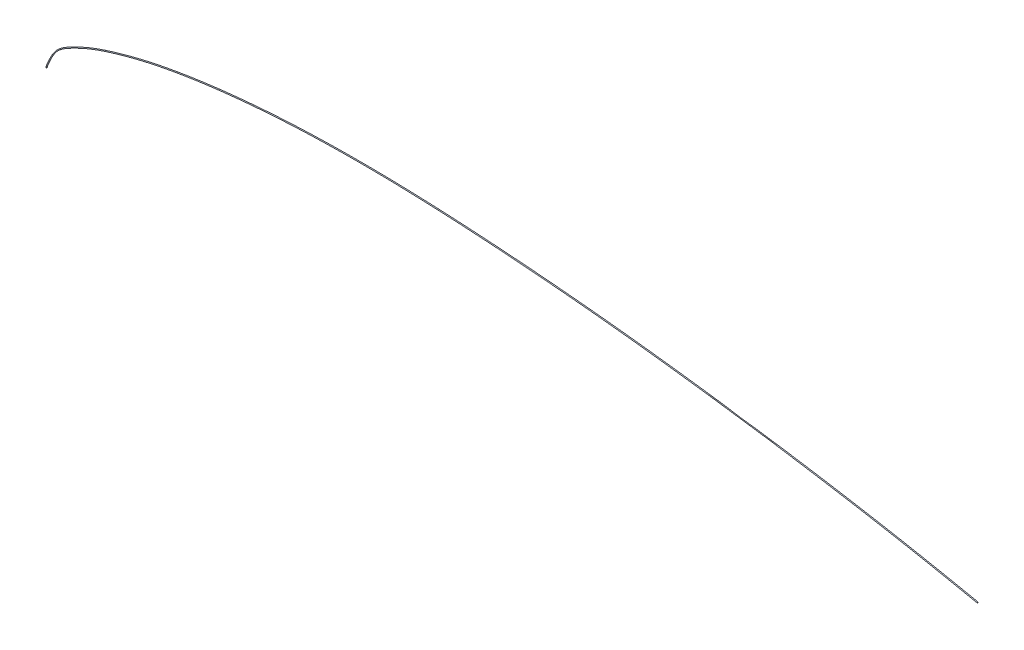
ISO-10303-21;
HEADER;
FILE_DESCRIPTION(('STEP AP214'),'2;1');
FILE_NAME('part.step','',(''),(''),'','','');
FILE_SCHEMA(('AUTOMOTIVE_DESIGN { 1 0 10303 214 1 1 1 1 }'));
ENDSEC;
DATA;
#1=APPLICATION_CONTEXT('core data for automotive mechanical design processes');
#2=APPLICATION_PROTOCOL_DEFINITION('international standard','automotive_design',2000,#1);
#3=PRODUCT_CONTEXT('',#1,'mechanical');
#4=PRODUCT('Part','Part','',(#3));
#5=PRODUCT_RELATED_PRODUCT_CATEGORY('part','',(#4));
#6=PRODUCT_DEFINITION_FORMATION('','',#4);
#7=PRODUCT_DEFINITION_CONTEXT('part definition',#1,'design');
#8=PRODUCT_DEFINITION('design','',#6,#7);
#9=PRODUCT_DEFINITION_SHAPE('','',#8);
#10=(LENGTH_UNIT() NAMED_UNIT(*) SI_UNIT(.MILLI.,.METRE.));
#11=(NAMED_UNIT(*) PLANE_ANGLE_UNIT() SI_UNIT($,.RADIAN.));
#12=(NAMED_UNIT(*) SI_UNIT($,.STERADIAN.) SOLID_ANGLE_UNIT());
#13=UNCERTAINTY_MEASURE_WITH_UNIT(LENGTH_MEASURE(1.E-05),#10,'distance_accuracy_value','');
#14=(GEOMETRIC_REPRESENTATION_CONTEXT(3) GLOBAL_UNCERTAINTY_ASSIGNED_CONTEXT((#13)) GLOBAL_UNIT_ASSIGNED_CONTEXT((#10,
#11,#12)) REPRESENTATION_CONTEXT('',''));
#15=CARTESIAN_POINT('',(0.,0.,0.));
#16=DIRECTION('',(0.,0.,1.));
#17=DIRECTION('',(1.,0.,0.));
#18=AXIS2_PLACEMENT_3D('',#15,#16,#17);
#19=CARTESIAN_POINT('',(982.37,1.277081,0.));
#20=DIRECTION('',(0.98101772640487,0.193918076721638,0.));
#21=DIRECTION('',(0.,0.,1.));
#22=AXIS2_PLACEMENT_3D('',#19,#20,#21);
#23=PLANE('',#22);
#24=CARTESIAN_POINT('',(982.37,1.277081,0.));
#25=DIRECTION('',(0.98101772640487,0.193918076721638,0.));
#26=DIRECTION('',(0.,0.,1.));
#27=AXIS2_PLACEMENT_3D('',#24,#25,#26);
#28=CIRCLE('',#27,0.5);
#29=CARTESIAN_POINT('',(982.37,1.277081,0.5));
#30=VERTEX_POINT('',#29);
#31=EDGE_CURVE('E10',#30,#30,#28,.T.);
#32=ORIENTED_EDGE('',*,*,#31,.T.);
#33=EDGE_LOOP('',(#32));
#34=FACE_BOUND('',#33,.T.);
#35=ADVANCED_FACE('F37',(#34),#23,.T.);
#36=CARTESIAN_POINT('',(982.37,1.277081,0.5));
#37=CARTESIAN_POINT('',(966.006247692632,4.63023753531084,0.5));
#38=CARTESIAN_POINT('',(949.64249538203,7.98339407107312,0.5));
#39=CARTESIAN_POINT('',(884.325588967302,20.7974180113734,0.5));
#40=CARTESIAN_POINT('',(835.170749762555,29.2208354174456,0.5));
#41=CARTESIAN_POINT('',(753.204713954217,41.8930561435161,0.5));
#42=CARTESIAN_POINT('',(720.457598988852,46.5816054311459,0.5));
#43=CARTESIAN_POINT('',(654.965430300209,55.178140371645,0.5));
#44=CARTESIAN_POINT('',(622.220705780157,59.088577507133,0.5));
#45=CARTESIAN_POINT('',(556.72340320794,65.8585389828754,0.5));
#46=CARTESIAN_POINT('',(523.971154173901,68.7212345165416,0.5));
#47=CARTESIAN_POINT('',(458.473890529683,73.5204427017436,0.5));
#48=CARTESIAN_POINT('',(425.729030955599,75.4590603090154,0.5));
#49=CARTESIAN_POINT('',(360.217201786401,77.7888732518948,0.5));
#50=CARTESIAN_POINT('',(327.450342968571,78.1824352617219,0.5));
#51=CARTESIAN_POINT('',(261.903332539602,76.6374663029844,0.5));
#52=CARTESIAN_POINT('',(229.113072819916,74.7211664786091,0.5));
#53=CARTESIAN_POINT('',(179.965527901329,69.5998220072903,0.5));
#54=CARTESIAN_POINT('',(163.498338532072,67.4928260856141,0.5));
#55=CARTESIAN_POINT('',(130.697575950852,62.2949459092975,0.5));
#56=CARTESIAN_POINT('',(114.364585446865,59.2029975403183,0.5));
#57=CARTESIAN_POINT('',(89.9285245792287,53.3005454090448,0.5));
#58=CARTESIAN_POINT('',(81.6745496994335,51.0803969997088,0.5));
#59=CARTESIAN_POINT('',(65.2472627690558,46.243098791399,0.5));
#60=CARTESIAN_POINT('',(57.0755665289918,43.6238149687629,0.5));
#61=CARTESIAN_POINT('',(43.9833416859353,38.6022903177345,0.5));
#62=CARTESIAN_POINT('',(38.9375739069987,36.4525063723427,0.5));
#63=CARTESIAN_POINT('',(31.4498674362683,32.913379283491,0.5));
#64=CARTESIAN_POINT('',(28.9674561457282,31.681261725483,0.5));
#65=CARTESIAN_POINT('',(24.0207585296471,29.1048493398776,0.5));
#66=CARTESIAN_POINT('',(21.5337905450468,27.7759853581103,0.5));
#67=CARTESIAN_POINT('',(16.7882920380453,24.8496141050762,0.5));
#68=CARTESIAN_POINT('',(14.5377722111785,23.2466569766948,0.5));
#69=CARTESIAN_POINT('',(10.5905898574913,19.5373232835405,0.5));
#70=CARTESIAN_POINT('',(8.90492918725965,17.4222238719549,0.5));
#71=CARTESIAN_POINT('',(4.42778144185482,10.5529103062656,0.5));
#72=CARTESIAN_POINT('',(2.21389071966054,5.27645515427274,0.5));
#73=CARTESIAN_POINT('',(0.,0.,0.5));
#74=CARTESIAN_POINT('',(982.563918076722,0.29606327359513,0.5));
#75=CARTESIAN_POINT('',(966.200165767499,3.64921980892499,0.5));
#76=CARTESIAN_POINT('',(949.839160604952,7.00290740477424,0.5));
#77=CARTESIAN_POINT('',(884.544092714158,19.8214389613463,0.5));
#78=CARTESIAN_POINT('',(835.40131775265,28.2477143375043,0.5));
#79=CARTESIAN_POINT('',(753.453418381785,40.9244480332833,0.5));
#80=CARTESIAN_POINT('',(720.713682314235,45.6149192850411,0.5));
#81=CARTESIAN_POINT('',(655.236529757715,54.2155576629643,0.5));
#82=CARTESIAN_POINT('',(622.500629401233,58.1284969837561,0.5));
#83=CARTESIAN_POINT('',(557.023538067243,64.9045839369948,0.5));
#84=CARTESIAN_POINT('',(524.280762680364,67.7703243225816,0.5));
#85=CARTESIAN_POINT('',(458.801225424324,72.5754881578468,0.5));
#86=CARTESIAN_POINT('',(426.06821064823,74.5182073184651,0.5));
#87=CARTESIAN_POINT('',(360.58577013235,76.8591400470335,0.5));
#88=CARTESIAN_POINT('',(327.837209483476,77.2599943142502,0.5));
#89=CARTESIAN_POINT('',(262.333558984971,75.7344322172876,0.5));
#90=CARTESIAN_POINT('',(229.566371993328,73.8292730265615,0.5));
#91=CARTESIAN_POINT('',(180.459619649967,68.730271884403,0.5));
#92=CARTESIAN_POINT('',(164.007817596871,66.6321112630241,0.5));
#93=CARTESIAN_POINT('',(131.241017201513,61.4552611290608,0.5));
#94=CARTESIAN_POINT('',(114.930337108243,58.3777486950091,0.5));
#95=CARTESIAN_POINT('',(90.5349492372928,52.5052191305762,0.5));
#96=CARTESIAN_POINT('',(82.2938385739548,50.2950726401932,0.5));
#97=CARTESIAN_POINT('',(65.8912176146056,45.4778699258685,0.5));
#98=CARTESIAN_POINT('',(57.7398604672087,42.8753977992402,0.5));
#99=CARTESIAN_POINT('',(44.6923426157801,37.8966651450928,0.5));
#100=CARTESIAN_POINT('',(39.664263852104,35.7650613796964,0.5));
#101=CARTESIAN_POINT('',(32.2022911793308,32.2545748857836,0.5));
#102=CARTESIAN_POINT('',(29.7283254048874,31.0322284458354,0.5));
#103=CARTESIAN_POINT('',(24.7981079747776,28.475648205275,0.5));
#104=CARTESIAN_POINT('',(22.3216395958269,27.1585617769766,0.5));
#105=CARTESIAN_POINT('',(17.6271013267159,24.3034300862453,0.5));
#106=CARTESIAN_POINT('',(15.4138163425942,22.7557596830098,0.5));
#107=CARTESIAN_POINT('',(11.5413894191943,19.2141922479197,0.5));
#108=CARTESIAN_POINT('',(9.87748593080348,17.1812874766036,0.5));
#109=CARTESIAN_POINT('',(5.43401535512678,10.4966859659683,0.5));
#110=CARTESIAN_POINT('',(3.21389071965992,5.27645515427274,0.5));
#111=CARTESIAN_POINT('',(1.,0.,0.5));
#112=CARTESIAN_POINT('',(982.563918076722,0.29606327359513,-0.5));
#113=CARTESIAN_POINT('',(966.200165767499,3.64921980892499,-0.5));
#114=CARTESIAN_POINT('',(949.839160604952,7.00290740477424,-0.5));
#115=CARTESIAN_POINT('',(884.544092714158,19.8214389613463,-0.5));
#116=CARTESIAN_POINT('',(835.40131775265,28.2477143375043,-0.5));
#117=CARTESIAN_POINT('',(753.453418381785,40.9244480332833,-0.5));
#118=CARTESIAN_POINT('',(720.713682314235,45.6149192850411,-0.5));
#119=CARTESIAN_POINT('',(655.236529757715,54.2155576629643,-0.5));
#120=CARTESIAN_POINT('',(622.500629401233,58.1284969837561,-0.5));
#121=CARTESIAN_POINT('',(557.023538067243,64.9045839369948,-0.5));
#122=CARTESIAN_POINT('',(524.280762680364,67.7703243225816,-0.5));
#123=CARTESIAN_POINT('',(458.801225424324,72.5754881578468,-0.5));
#124=CARTESIAN_POINT('',(426.06821064823,74.5182073184651,-0.5));
#125=CARTESIAN_POINT('',(360.58577013235,76.8591400470335,-0.5));
#126=CARTESIAN_POINT('',(327.837209483476,77.2599943142502,-0.5));
#127=CARTESIAN_POINT('',(262.333558984971,75.7344322172876,-0.5));
#128=CARTESIAN_POINT('',(229.566371993328,73.8292730265615,-0.5));
#129=CARTESIAN_POINT('',(180.459619649967,68.730271884403,-0.5));
#130=CARTESIAN_POINT('',(164.007817596871,66.6321112630241,-0.5));
#131=CARTESIAN_POINT('',(131.241017201513,61.4552611290608,-0.5));
#132=CARTESIAN_POINT('',(114.930337108243,58.3777486950091,-0.5));
#133=CARTESIAN_POINT('',(90.5349492372928,52.5052191305762,-0.5));
#134=CARTESIAN_POINT('',(82.2938385739548,50.2950726401932,-0.5));
#135=CARTESIAN_POINT('',(65.8912176146056,45.4778699258685,-0.5));
#136=CARTESIAN_POINT('',(57.7398604672087,42.8753977992402,-0.5));
#137=CARTESIAN_POINT('',(44.6923426157801,37.8966651450928,-0.5));
#138=CARTESIAN_POINT('',(39.664263852104,35.7650613796964,-0.5));
#139=CARTESIAN_POINT('',(32.2022911793308,32.2545748857836,-0.5));
#140=CARTESIAN_POINT('',(29.7283254048874,31.0322284458354,-0.5));
#141=CARTESIAN_POINT('',(24.7981079747776,28.475648205275,-0.5));
#142=CARTESIAN_POINT('',(22.3216395958269,27.1585617769766,-0.5));
#143=CARTESIAN_POINT('',(17.6271013267159,24.3034300862453,-0.5));
#144=CARTESIAN_POINT('',(15.4138163425942,22.7557596830098,-0.5));
#145=CARTESIAN_POINT('',(11.5413894191943,19.2141922479197,-0.5));
#146=CARTESIAN_POINT('',(9.87748593080348,17.1812874766036,-0.5));
#147=CARTESIAN_POINT('',(5.43401535512678,10.4966859659683,-0.5));
#148=CARTESIAN_POINT('',(3.21389071965992,5.27645515427274,-0.5));
#149=CARTESIAN_POINT('',(1.,0.,-0.5));
#150=CARTESIAN_POINT('',(982.37,1.277081,-0.5));
#151=CARTESIAN_POINT('',(966.006247692632,4.63023753531084,-0.5));
#152=CARTESIAN_POINT('',(949.64249538203,7.98339407107312,-0.5));
#153=CARTESIAN_POINT('',(884.325588967302,20.7974180113734,-0.5));
#154=CARTESIAN_POINT('',(835.170749762555,29.2208354174456,-0.5));
#155=CARTESIAN_POINT('',(753.204713954217,41.8930561435161,-0.5));
#156=CARTESIAN_POINT('',(720.457598988852,46.5816054311459,-0.5));
#157=CARTESIAN_POINT('',(654.965430300209,55.178140371645,-0.5));
#158=CARTESIAN_POINT('',(622.220705780157,59.088577507133,-0.5));
#159=CARTESIAN_POINT('',(556.72340320794,65.8585389828754,-0.5));
#160=CARTESIAN_POINT('',(523.971154173901,68.7212345165416,-0.5));
#161=CARTESIAN_POINT('',(458.473890529683,73.5204427017436,-0.5));
#162=CARTESIAN_POINT('',(425.729030955599,75.4590603090154,-0.5));
#163=CARTESIAN_POINT('',(360.217201786401,77.7888732518948,-0.5));
#164=CARTESIAN_POINT('',(327.450342968571,78.1824352617219,-0.5));
#165=CARTESIAN_POINT('',(261.903332539602,76.6374663029844,-0.5));
#166=CARTESIAN_POINT('',(229.113072819916,74.7211664786091,-0.5));
#167=CARTESIAN_POINT('',(179.965527901329,69.5998220072903,-0.5));
#168=CARTESIAN_POINT('',(163.498338532072,67.4928260856141,-0.5));
#169=CARTESIAN_POINT('',(130.697575950852,62.2949459092975,-0.5));
#170=CARTESIAN_POINT('',(114.364585446865,59.2029975403183,-0.5));
#171=CARTESIAN_POINT('',(89.9285245792287,53.3005454090448,-0.5));
#172=CARTESIAN_POINT('',(81.6745496994335,51.0803969997088,-0.5));
#173=CARTESIAN_POINT('',(65.2472627690558,46.243098791399,-0.5));
#174=CARTESIAN_POINT('',(57.0755665289918,43.6238149687629,-0.5));
#175=CARTESIAN_POINT('',(43.9833416859353,38.6022903177345,-0.5));
#176=CARTESIAN_POINT('',(38.9375739069987,36.4525063723427,-0.5));
#177=CARTESIAN_POINT('',(31.4498674362683,32.913379283491,-0.5));
#178=CARTESIAN_POINT('',(28.9674561457282,31.681261725483,-0.5));
#179=CARTESIAN_POINT('',(24.0207585296471,29.1048493398776,-0.5));
#180=CARTESIAN_POINT('',(21.5337905450468,27.7759853581103,-0.5));
#181=CARTESIAN_POINT('',(16.7882920380453,24.8496141050762,-0.5));
#182=CARTESIAN_POINT('',(14.5377722111785,23.2466569766948,-0.5));
#183=CARTESIAN_POINT('',(10.5905898574913,19.5373232835405,-0.5));
#184=CARTESIAN_POINT('',(8.90492918725965,17.4222238719549,-0.5));
#185=CARTESIAN_POINT('',(4.42778144185482,10.5529103062656,-0.5));
#186=CARTESIAN_POINT('',(2.21389071966054,5.27645515427274,-0.5));
#187=CARTESIAN_POINT('',(0.,0.,-0.5));
#188=CARTESIAN_POINT('',(982.176081923278,2.25809872640487,-0.5));
#189=CARTESIAN_POINT('',(965.812329617764,5.6112552616967,-0.5));
#190=CARTESIAN_POINT('',(949.445830159108,8.96388073737201,-0.5));
#191=CARTESIAN_POINT('',(884.107085220446,21.7733970614004,-0.5));
#192=CARTESIAN_POINT('',(834.940181772459,30.1939564973869,-0.5));
#193=CARTESIAN_POINT('',(752.95600952665,42.8616642537489,-0.5));
#194=CARTESIAN_POINT('',(720.201515663469,47.5482915772508,-0.5));
#195=CARTESIAN_POINT('',(654.694330842703,56.1407230803257,-0.5));
#196=CARTESIAN_POINT('',(621.940782159082,60.0486580305098,-0.5));
#197=CARTESIAN_POINT('',(556.423268348636,66.8124940287559,-0.5));
#198=CARTESIAN_POINT('',(523.661545667439,69.6721447105017,-0.5));
#199=CARTESIAN_POINT('',(458.146555635041,74.4653972456404,-0.5));
#200=CARTESIAN_POINT('',(425.389851262968,76.3999132995658,-0.5));
#201=CARTESIAN_POINT('',(359.848633440452,78.7186064567562,-0.5));
#202=CARTESIAN_POINT('',(327.063476453665,79.1048762091936,-0.5));
#203=CARTESIAN_POINT('',(261.473106094233,77.5405003886812,-0.5));
#204=CARTESIAN_POINT('',(228.659773646503,75.6130599306568,-0.5));
#205=CARTESIAN_POINT('',(179.471436152691,70.4693721301776,-0.5));
#206=CARTESIAN_POINT('',(162.988859467274,68.3535409082041,-0.5));
#207=CARTESIAN_POINT('',(130.154134700192,63.1346306895341,-0.5));
#208=CARTESIAN_POINT('',(113.798833785488,60.0282463856275,-0.5));
#209=CARTESIAN_POINT('',(89.3220999211647,54.0958716875133,-0.5));
#210=CARTESIAN_POINT('',(81.0552608249122,51.8657213592243,-0.5));
#211=CARTESIAN_POINT('',(64.6033079235059,47.0083276569295,-0.5));
#212=CARTESIAN_POINT('',(56.4112725907748,44.3722321382856,-0.5));
#213=CARTESIAN_POINT('',(43.2743407560905,39.3079154903761,-0.5));
#214=CARTESIAN_POINT('',(38.2108839618934,37.1399513649891,-0.5));
#215=CARTESIAN_POINT('',(30.6974436932059,33.5721836811985,-0.5));
#216=CARTESIAN_POINT('',(28.2065868865691,32.3302950051305,-0.5));
#217=CARTESIAN_POINT('',(23.2434090845165,29.7340504744801,-0.5));
#218=CARTESIAN_POINT('',(20.7459414942667,28.393408939244,-0.5));
#219=CARTESIAN_POINT('',(15.9494827493746,25.3957981239071,-0.5));
#220=CARTESIAN_POINT('',(13.6617280797627,23.7375542703798,-0.5));
#221=CARTESIAN_POINT('',(9.63979029578835,19.8604543191613,-0.5));
#222=CARTESIAN_POINT('',(7.93237244371581,17.6631602673063,-0.5));
#223=CARTESIAN_POINT('',(3.42154752858286,10.6091346465629,-0.5));
#224=CARTESIAN_POINT('',(1.21389071966116,5.27645515427274,-0.5));
#225=CARTESIAN_POINT('',(-1.,0.,-0.5));
#226=CARTESIAN_POINT('',(982.176081923278,2.25809872640487,0.5));
#227=CARTESIAN_POINT('',(965.812329617764,5.6112552616967,0.5));
#228=CARTESIAN_POINT('',(949.445830159108,8.96388073737201,0.5));
#229=CARTESIAN_POINT('',(884.107085220446,21.7733970614004,0.5));
#230=CARTESIAN_POINT('',(834.940181772459,30.1939564973869,0.5));
#231=CARTESIAN_POINT('',(752.95600952665,42.8616642537489,0.5));
#232=CARTESIAN_POINT('',(720.201515663469,47.5482915772508,0.5));
#233=CARTESIAN_POINT('',(654.694330842703,56.1407230803257,0.5));
#234=CARTESIAN_POINT('',(621.940782159082,60.0486580305098,0.5));
#235=CARTESIAN_POINT('',(556.423268348636,66.8124940287559,0.5));
#236=CARTESIAN_POINT('',(523.661545667439,69.6721447105017,0.5));
#237=CARTESIAN_POINT('',(458.146555635041,74.4653972456404,0.5));
#238=CARTESIAN_POINT('',(425.389851262968,76.3999132995658,0.5));
#239=CARTESIAN_POINT('',(359.848633440452,78.7186064567562,0.5));
#240=CARTESIAN_POINT('',(327.063476453665,79.1048762091936,0.5));
#241=CARTESIAN_POINT('',(261.473106094233,77.5405003886812,0.5));
#242=CARTESIAN_POINT('',(228.659773646503,75.6130599306568,0.5));
#243=CARTESIAN_POINT('',(179.471436152691,70.4693721301776,0.5));
#244=CARTESIAN_POINT('',(162.988859467274,68.3535409082041,0.5));
#245=CARTESIAN_POINT('',(130.154134700192,63.1346306895341,0.5));
#246=CARTESIAN_POINT('',(113.798833785488,60.0282463856275,0.5));
#247=CARTESIAN_POINT('',(89.3220999211647,54.0958716875133,0.5));
#248=CARTESIAN_POINT('',(81.0552608249122,51.8657213592243,0.5));
#249=CARTESIAN_POINT('',(64.6033079235059,47.0083276569295,0.5));
#250=CARTESIAN_POINT('',(56.4112725907748,44.3722321382856,0.5));
#251=CARTESIAN_POINT('',(43.2743407560905,39.3079154903761,0.5));
#252=CARTESIAN_POINT('',(38.2108839618934,37.1399513649891,0.5));
#253=CARTESIAN_POINT('',(30.6974436932059,33.5721836811985,0.5));
#254=CARTESIAN_POINT('',(28.2065868865691,32.3302950051305,0.5));
#255=CARTESIAN_POINT('',(23.2434090845165,29.7340504744801,0.5));
#256=CARTESIAN_POINT('',(20.7459414942667,28.393408939244,0.5));
#257=CARTESIAN_POINT('',(15.9494827493746,25.3957981239071,0.5));
#258=CARTESIAN_POINT('',(13.6617280797627,23.7375542703798,0.5));
#259=CARTESIAN_POINT('',(9.63979029578835,19.8604543191613,0.5));
#260=CARTESIAN_POINT('',(7.93237244371581,17.6631602673063,0.5));
#261=CARTESIAN_POINT('',(3.42154752858286,10.6091346465629,0.5));
#262=CARTESIAN_POINT('',(1.21389071966116,5.27645515427274,0.5));
#263=CARTESIAN_POINT('',(-1.,0.,0.5));
#264=CARTESIAN_POINT('',(982.37,1.277081,0.5));
#265=CARTESIAN_POINT('',(966.006247692632,4.63023753531084,0.5));
#266=CARTESIAN_POINT('',(949.64249538203,7.98339407107312,0.5));
#267=CARTESIAN_POINT('',(884.325588967302,20.7974180113734,0.5));
#268=CARTESIAN_POINT('',(835.170749762555,29.2208354174456,0.5));
#269=CARTESIAN_POINT('',(753.204713954217,41.8930561435161,0.5));
#270=CARTESIAN_POINT('',(720.457598988852,46.5816054311459,0.5));
#271=CARTESIAN_POINT('',(654.965430300209,55.178140371645,0.5));
#272=CARTESIAN_POINT('',(622.220705780157,59.088577507133,0.5));
#273=CARTESIAN_POINT('',(556.72340320794,65.8585389828754,0.5));
#274=CARTESIAN_POINT('',(523.971154173901,68.7212345165416,0.5));
#275=CARTESIAN_POINT('',(458.473890529683,73.5204427017436,0.5));
#276=CARTESIAN_POINT('',(425.729030955599,75.4590603090154,0.5));
#277=CARTESIAN_POINT('',(360.217201786401,77.7888732518948,0.5));
#278=CARTESIAN_POINT('',(327.450342968571,78.1824352617219,0.5));
#279=CARTESIAN_POINT('',(261.903332539602,76.6374663029844,0.5));
#280=CARTESIAN_POINT('',(229.113072819916,74.7211664786091,0.5));
#281=CARTESIAN_POINT('',(179.965527901329,69.5998220072903,0.5));
#282=CARTESIAN_POINT('',(163.498338532072,67.4928260856141,0.5));
#283=CARTESIAN_POINT('',(130.697575950852,62.2949459092975,0.5));
#284=CARTESIAN_POINT('',(114.364585446865,59.2029975403183,0.5));
#285=CARTESIAN_POINT('',(89.9285245792287,53.3005454090448,0.5));
#286=CARTESIAN_POINT('',(81.6745496994335,51.0803969997088,0.5));
#287=CARTESIAN_POINT('',(65.2472627690558,46.243098791399,0.5));
#288=CARTESIAN_POINT('',(57.0755665289918,43.6238149687629,0.5));
#289=CARTESIAN_POINT('',(43.9833416859353,38.6022903177345,0.5));
#290=CARTESIAN_POINT('',(38.9375739069987,36.4525063723427,0.5));
#291=CARTESIAN_POINT('',(31.4498674362683,32.913379283491,0.5));
#292=CARTESIAN_POINT('',(28.9674561457282,31.681261725483,0.5));
#293=CARTESIAN_POINT('',(24.0207585296471,29.1048493398776,0.5));
#294=CARTESIAN_POINT('',(21.5337905450468,27.7759853581103,0.5));
#295=CARTESIAN_POINT('',(16.7882920380453,24.8496141050762,0.5));
#296=CARTESIAN_POINT('',(14.5377722111785,23.2466569766948,0.5));
#297=CARTESIAN_POINT('',(10.5905898574913,19.5373232835405,0.5));
#298=CARTESIAN_POINT('',(8.90492918725965,17.4222238719549,0.5));
#299=CARTESIAN_POINT('',(4.42778144185482,10.5529103062656,0.5));
#300=CARTESIAN_POINT('',(2.21389071966054,5.27645515427274,0.5));
#301=CARTESIAN_POINT('',(0.,0.,0.5));
#302=(BOUNDED_SURFACE() B_SPLINE_SURFACE(3,3,((#36,#37,#38,#39,#40,#41,#42,#43,#44,#45,#46,#47,
#48,#49,#50,#51,#52,#53,#54,#55,#56,#57,#58,#59,#60,#61,#62,#63,#64,#65,#66,#67,#68,#69,#70,#71,
#72,#73),(#74,#75,#76,#77,#78,#79,#80,#81,#82,#83,#84,#85,#86,#87,#88,#89,#90,#91,#92,#93,#94,
#95,#96,#97,#98,#99,#100,#101,#102,#103,#104,#105,#106,#107,#108,#109,#110,#111),(#112,#113,
#114,#115,#116,#117,#118,#119,#120,#121,#122,#123,#124,#125,#126,#127,#128,#129,#130,#131,#132,
#133,#134,#135,#136,#137,#138,#139,#140,#141,#142,#143,#144,#145,#146,#147,#148,#149),(#150,
#151,#152,#153,#154,#155,#156,#157,#158,#159,#160,#161,#162,#163,#164,#165,#166,#167,#168,#169,
#170,#171,#172,#173,#174,#175,#176,#177,#178,#179,#180,#181,#182,#183,#184,#185,#186,#187),
(#188,#189,#190,#191,#192,#193,#194,#195,#196,#197,#198,#199,#200,#201,#202,#203,#204,#205,#206,
#207,#208,#209,#210,#211,#212,#213,#214,#215,#216,#217,#218,#219,#220,#221,#222,#223,#224,#225),
(#226,#227,#228,#229,#230,#231,#232,#233,#234,#235,#236,#237,#238,#239,#240,#241,#242,#243,#244,
#245,#246,#247,#248,#249,#250,#251,#252,#253,#254,#255,#256,#257,#258,#259,#260,#261,#262,#263),
(#264,#265,#266,#267,#268,#269,#270,#271,#272,#273,#274,#275,#276,#277,#278,#279,#280,#281,#282,
#283,#284,#285,#286,#287,#288,#289,#290,#291,#292,#293,#294,#295,#296,#297,#298,#299,#300,
#301)),.UNSPECIFIED.,.T.,.F.,.F.) B_SPLINE_SURFACE_WITH_KNOTS((4,3,4),(4,2,2,2,2,2,2,2,2,2,2,2,
2,2,2,2,2,2,4),(0.,0.5,1.),(0.,0.0496812988513002,0.197976307844625,0.296362491062684,
0.394433617199178,0.492205408317245,0.589753408165241,0.68715192816571,0.784753711389578,
0.834119584128113,0.883485456866648,0.908917356863356,0.934349256860064,0.950761942645048,
0.95896828553754,0.967174628430032,0.975380971322524,0.983587314215016,1.),
.UNSPECIFIED.) GEOMETRIC_REPRESENTATION_ITEM() RATIONAL_B_SPLINE_SURFACE(((1.,1.,1.,1.,1.,1.,1.,
1.,1.,1.,1.,1.,1.,1.,1.,1.,1.,1.,1.,1.,1.,1.,1.,1.,1.,1.,1.,1.,1.,1.,1.,1.,1.,1.,1.,1.,1.,1.),
(0.333333333333333,0.333333333333333,0.333333333333333,0.333333333333333,0.333333333333333,
0.333333333333333,0.333333333333333,0.333333333333333,0.333333333333333,0.333333333333333,
0.333333333333333,0.333333333333333,0.333333333333333,0.333333333333333,0.333333333333333,
0.333333333333333,0.333333333333333,0.333333333333333,0.333333333333333,0.333333333333333,
0.333333333333333,0.333333333333333,0.333333333333333,0.333333333333333,0.333333333333333,
0.333333333333333,0.333333333333333,0.333333333333333,0.333333333333333,0.333333333333333,
0.333333333333333,0.333333333333333,0.333333333333333,0.333333333333333,0.333333333333333,
0.333333333333333,0.333333333333333,0.333333333333333),(0.333333333333333,0.333333333333333,
0.333333333333333,0.333333333333333,0.333333333333333,0.333333333333333,0.333333333333333,
0.333333333333333,0.333333333333333,0.333333333333333,0.333333333333333,0.333333333333333,
0.333333333333333,0.333333333333333,0.333333333333333,0.333333333333333,0.333333333333333,
0.333333333333333,0.333333333333333,0.333333333333333,0.333333333333333,0.333333333333333,
0.333333333333333,0.333333333333333,0.333333333333333,0.333333333333333,0.333333333333333,
0.333333333333333,0.333333333333333,0.333333333333333,0.333333333333333,0.333333333333333,
0.333333333333333,0.333333333333333,0.333333333333333,0.333333333333333,0.333333333333333,
0.333333333333333),(1.,1.,1.,1.,1.,1.,1.,1.,1.,1.,1.,1.,1.,1.,1.,1.,1.,1.,1.,1.,1.,1.,1.,1.,1.,
1.,1.,1.,1.,1.,1.,1.,1.,1.,1.,1.,1.,1.),(0.333333333333333,0.333333333333333,0.333333333333333,
0.333333333333333,0.333333333333333,0.333333333333333,0.333333333333333,0.333333333333333,
0.333333333333333,0.333333333333333,0.333333333333333,0.333333333333333,0.333333333333333,
0.333333333333333,0.333333333333333,0.333333333333333,0.333333333333333,0.333333333333333,
0.333333333333333,0.333333333333333,0.333333333333333,0.333333333333333,0.333333333333333,
0.333333333333333,0.333333333333333,0.333333333333333,0.333333333333333,0.333333333333333,
0.333333333333333,0.333333333333333,0.333333333333333,0.333333333333333,0.333333333333333,
0.333333333333333,0.333333333333333,0.333333333333333,0.333333333333333,0.333333333333333),
(0.333333333333333,0.333333333333333,0.333333333333333,0.333333333333333,0.333333333333333,
0.333333333333333,0.333333333333333,0.333333333333333,0.333333333333333,0.333333333333333,
0.333333333333333,0.333333333333333,0.333333333333333,0.333333333333333,0.333333333333333,
0.333333333333333,0.333333333333333,0.333333333333333,0.333333333333333,0.333333333333333,
0.333333333333333,0.333333333333333,0.333333333333333,0.333333333333333,0.333333333333333,
0.333333333333333,0.333333333333333,0.333333333333333,0.333333333333333,0.333333333333333,
0.333333333333333,0.333333333333333,0.333333333333333,0.333333333333333,0.333333333333333,
0.333333333333333,0.333333333333333,0.333333333333333),(1.,1.,1.,1.,1.,1.,1.,1.,1.,1.,1.,1.,1.,
1.,1.,1.,1.,1.,1.,1.,1.,1.,1.,1.,1.,1.,1.,1.,1.,1.,1.,1.,1.,1.,1.,1.,1.,1.))) REPRESENTATION_ITEM('') SURFACE());
#303=CARTESIAN_POINT('',(0.,0.,0.));
#304=DIRECTION('',(0.,1.,0.));
#305=DIRECTION('',(0.,0.,1.));
#306=AXIS2_PLACEMENT_3D('',#303,#304,#305);
#307=CIRCLE('',#306,0.5);
#308=CARTESIAN_POINT('',(0.,0.,0.5));
#309=VERTEX_POINT('',#308);
#310=EDGE_CURVE('E47',#309,#309,#307,.T.);
#311=ORIENTED_EDGE('',*,*,#310,.T.);
#312=EDGE_LOOP('',(#311));
#313=FACE_BOUND('',#312,.T.);
#314=ORIENTED_EDGE('',*,*,#31,.F.);
#315=EDGE_LOOP('',(#314));
#316=FACE_BOUND('',#315,.T.);
#317=ADVANCED_FACE('F54',(#313,#316),#302,.F.);
#318=CARTESIAN_POINT('',(0.,-1.,0.));
#319=DIRECTION('',(0.,1.,0.));
#320=DIRECTION('',(0.,0.,1.));
#321=AXIS2_PLACEMENT_3D('',#318,#319,#320);
#322=CYLINDRICAL_SURFACE('',#321,0.5);
#323=CARTESIAN_POINT('',(0.,-1.,0.));
#324=DIRECTION('',(0.,1.,0.));
#325=DIRECTION('',(0.,0.,1.));
#326=AXIS2_PLACEMENT_3D('',#323,#324,#325);
#327=CIRCLE('',#326,0.5);
#328=CARTESIAN_POINT('',(0.,-1.,0.5));
#329=VERTEX_POINT('',#328);
#330=EDGE_CURVE('E43',#329,#329,#327,.T.);
#331=ORIENTED_EDGE('',*,*,#330,.T.);
#332=EDGE_LOOP('',(#331));
#333=FACE_BOUND('',#332,.T.);
#334=ORIENTED_EDGE('',*,*,#310,.F.);
#335=EDGE_LOOP('',(#334));
#336=FACE_BOUND('',#335,.T.);
#337=ADVANCED_FACE('F57',(#333,#336),#322,.T.);
#338=CARTESIAN_POINT('',(0.,-1.,0.));
#339=DIRECTION('',(0.,1.,0.));
#340=DIRECTION('',(0.,0.,1.));
#341=AXIS2_PLACEMENT_3D('',#338,#339,#340);
#342=PLANE('',#341);
#343=ORIENTED_EDGE('',*,*,#330,.F.);
#344=EDGE_LOOP('',(#343));
#345=FACE_BOUND('',#344,.T.);
#346=ADVANCED_FACE('F59',(#345),#342,.F.);
#347=CLOSED_SHELL('',(#35,#317,#337,#346));
#348=MANIFOLD_SOLID_BREP('B2',#347);
#349=ADVANCED_BREP_SHAPE_REPRESENTATION('',(#18,#348),#14);
#350=SHAPE_DEFINITION_REPRESENTATION(#9,#349);
ENDSEC;
END-ISO-10303-21;
